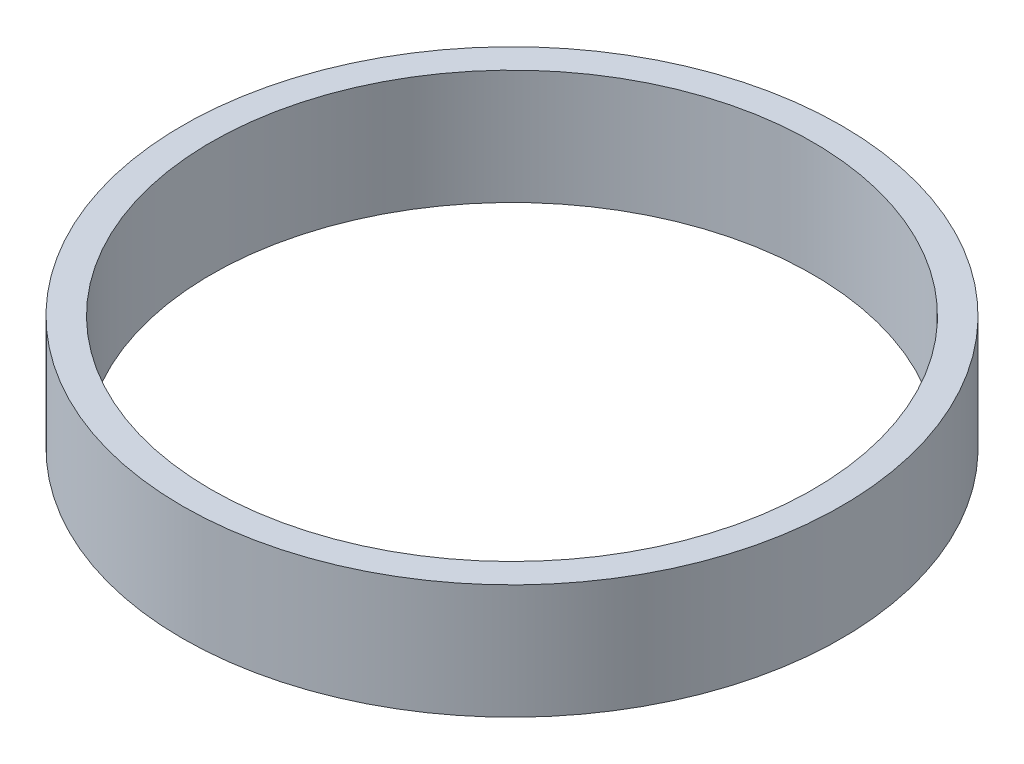
ISO-10303-21;
HEADER;
FILE_DESCRIPTION(('STEP AP214'),'2;1');
FILE_NAME('part.step','',(''),(''),'','','');
FILE_SCHEMA(('AUTOMOTIVE_DESIGN { 1 0 10303 214 1 1 1 1 }'));
ENDSEC;
DATA;
#1=APPLICATION_CONTEXT('core data for automotive mechanical design processes');
#2=APPLICATION_PROTOCOL_DEFINITION('international standard','automotive_design',2000,#1);
#3=PRODUCT_CONTEXT('',#1,'mechanical');
#4=PRODUCT('Part','Part','',(#3));
#5=PRODUCT_RELATED_PRODUCT_CATEGORY('part','',(#4));
#6=PRODUCT_DEFINITION_FORMATION('','',#4);
#7=PRODUCT_DEFINITION_CONTEXT('part definition',#1,'design');
#8=PRODUCT_DEFINITION('design','',#6,#7);
#9=PRODUCT_DEFINITION_SHAPE('','',#8);
#10=(LENGTH_UNIT() NAMED_UNIT(*) SI_UNIT(.MILLI.,.METRE.));
#11=(NAMED_UNIT(*) PLANE_ANGLE_UNIT() SI_UNIT($,.RADIAN.));
#12=(NAMED_UNIT(*) SI_UNIT($,.STERADIAN.) SOLID_ANGLE_UNIT());
#13=UNCERTAINTY_MEASURE_WITH_UNIT(LENGTH_MEASURE(1.E-05),#10,'distance_accuracy_value','');
#14=(GEOMETRIC_REPRESENTATION_CONTEXT(3) GLOBAL_UNCERTAINTY_ASSIGNED_CONTEXT((#13)) GLOBAL_UNIT_ASSIGNED_CONTEXT((#10,
#11,#12)) REPRESENTATION_CONTEXT('',''));
#15=CARTESIAN_POINT('',(0.,0.,0.));
#16=DIRECTION('',(0.,0.,1.));
#17=DIRECTION('',(1.,0.,0.));
#18=AXIS2_PLACEMENT_3D('',#15,#16,#17);
#19=CARTESIAN_POINT('',(0.,4.,0.));
#20=DIRECTION('',(0.,1.,0.));
#21=DIRECTION('',(0.,0.,1.));
#22=AXIS2_PLACEMENT_3D('',#19,#20,#21);
#23=PLANE('',#22);
#24=CARTESIAN_POINT('',(0.,4.,0.));
#25=DIRECTION('',(0.,1.,0.));
#26=DIRECTION('',(0.,0.,1.));
#27=AXIS2_PLACEMENT_3D('',#24,#25,#26);
#28=CIRCLE('',#27,11.5);
#29=CARTESIAN_POINT('',(0.,4.,11.5));
#30=VERTEX_POINT('',#29);
#31=EDGE_CURVE('E10',#30,#30,#28,.T.);
#32=ORIENTED_EDGE('',*,*,#31,.T.);
#33=EDGE_LOOP('',(#32));
#34=FACE_BOUND('',#33,.T.);
#35=CARTESIAN_POINT('',(0.,4.,0.));
#36=DIRECTION('',(0.,1.,0.));
#37=DIRECTION('',(0.,0.,1.));
#38=AXIS2_PLACEMENT_3D('',#35,#36,#37);
#39=CIRCLE('',#38,10.5);
#40=CARTESIAN_POINT('',(0.,4.,10.5));
#41=VERTEX_POINT('',#40);
#42=EDGE_CURVE('E52',#41,#41,#39,.T.);
#43=ORIENTED_EDGE('',*,*,#42,.F.);
#44=EDGE_LOOP('',(#43));
#45=FACE_BOUND('',#44,.T.);
#46=ADVANCED_FACE('F39',(#34,#45),#23,.T.);
#47=CARTESIAN_POINT('',(0.,0.,0.));
#48=DIRECTION('',(0.,1.,0.));
#49=DIRECTION('',(0.,0.,1.));
#50=AXIS2_PLACEMENT_3D('',#47,#48,#49);
#51=PLANE('',#50);
#52=CARTESIAN_POINT('',(0.,0.,0.));
#53=DIRECTION('',(0.,1.,0.));
#54=DIRECTION('',(0.,0.,1.));
#55=AXIS2_PLACEMENT_3D('',#52,#53,#54);
#56=CIRCLE('',#55,11.5);
#57=CARTESIAN_POINT('',(0.,0.,11.5));
#58=VERTEX_POINT('',#57);
#59=EDGE_CURVE('E43',#58,#58,#56,.T.);
#60=ORIENTED_EDGE('',*,*,#59,.F.);
#61=EDGE_LOOP('',(#60));
#62=FACE_BOUND('',#61,.T.);
#63=CARTESIAN_POINT('',(0.,0.,0.));
#64=DIRECTION('',(0.,1.,0.));
#65=DIRECTION('',(0.,0.,1.));
#66=AXIS2_PLACEMENT_3D('',#63,#64,#65);
#67=CIRCLE('',#66,10.5);
#68=CARTESIAN_POINT('',(0.,0.,10.5));
#69=VERTEX_POINT('',#68);
#70=EDGE_CURVE('E54',#69,#69,#67,.T.);
#71=ORIENTED_EDGE('',*,*,#70,.T.);
#72=EDGE_LOOP('',(#71));
#73=FACE_BOUND('',#72,.T.);
#74=ADVANCED_FACE('F66',(#62,#73),#51,.F.);
#75=CARTESIAN_POINT('',(0.,4.,0.));
#76=DIRECTION('',(0.,-1.,0.));
#77=DIRECTION('',(0.,0.,-1.));
#78=AXIS2_PLACEMENT_3D('',#75,#76,#77);
#79=CYLINDRICAL_SURFACE('',#78,11.5);
#80=ORIENTED_EDGE('',*,*,#31,.F.);
#81=EDGE_LOOP('',(#80));
#82=FACE_BOUND('',#81,.T.);
#83=ORIENTED_EDGE('',*,*,#59,.T.);
#84=EDGE_LOOP('',(#83));
#85=FACE_BOUND('',#84,.T.);
#86=ADVANCED_FACE('F41',(#82,#85),#79,.T.);
#87=CARTESIAN_POINT('',(0.,4.,0.));
#88=DIRECTION('',(0.,-1.,0.));
#89=DIRECTION('',(0.,0.,-1.));
#90=AXIS2_PLACEMENT_3D('',#87,#88,#89);
#91=CYLINDRICAL_SURFACE('',#90,10.5);
#92=ORIENTED_EDGE('',*,*,#42,.T.);
#93=EDGE_LOOP('',(#92));
#94=FACE_BOUND('',#93,.T.);
#95=ORIENTED_EDGE('',*,*,#70,.F.);
#96=EDGE_LOOP('',(#95));
#97=FACE_BOUND('',#96,.T.);
#98=ADVANCED_FACE('F62',(#94,#97),#91,.F.);
#99=CLOSED_SHELL('',(#46,#74,#86,#98));
#100=MANIFOLD_SOLID_BREP('B2',#99);
#101=ADVANCED_BREP_SHAPE_REPRESENTATION('',(#18,#100),#14);
#102=SHAPE_DEFINITION_REPRESENTATION(#9,#101);
ENDSEC;
END-ISO-10303-21;
